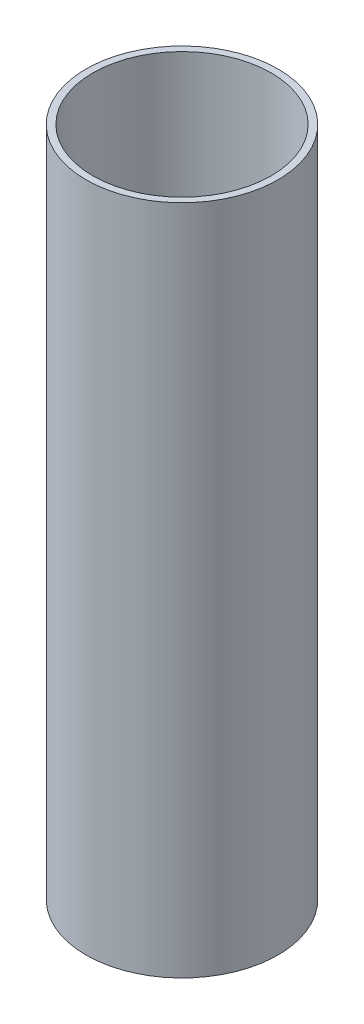
ISO-10303-21;
HEADER;
FILE_DESCRIPTION(('STEP AP214'),'2;1');
FILE_NAME('part.step','',(''),(''),'','','');
FILE_SCHEMA(('AUTOMOTIVE_DESIGN { 1 0 10303 214 1 1 1 1 }'));
ENDSEC;
DATA;
#1=APPLICATION_CONTEXT('core data for automotive mechanical design processes');
#2=APPLICATION_PROTOCOL_DEFINITION('international standard','automotive_design',2000,#1);
#3=PRODUCT_CONTEXT('',#1,'mechanical');
#4=PRODUCT('Part','Part','',(#3));
#5=PRODUCT_RELATED_PRODUCT_CATEGORY('part','',(#4));
#6=PRODUCT_DEFINITION_FORMATION('','',#4);
#7=PRODUCT_DEFINITION_CONTEXT('part definition',#1,'design');
#8=PRODUCT_DEFINITION('design','',#6,#7);
#9=PRODUCT_DEFINITION_SHAPE('','',#8);
#10=(LENGTH_UNIT() NAMED_UNIT(*) SI_UNIT(.MILLI.,.METRE.));
#11=(NAMED_UNIT(*) PLANE_ANGLE_UNIT() SI_UNIT($,.RADIAN.));
#12=(NAMED_UNIT(*) SI_UNIT($,.STERADIAN.) SOLID_ANGLE_UNIT());
#13=UNCERTAINTY_MEASURE_WITH_UNIT(LENGTH_MEASURE(1.E-05),#10,'distance_accuracy_value','');
#14=(GEOMETRIC_REPRESENTATION_CONTEXT(3) GLOBAL_UNCERTAINTY_ASSIGNED_CONTEXT((#13)) GLOBAL_UNIT_ASSIGNED_CONTEXT((#10,
#11,#12)) REPRESENTATION_CONTEXT('',''));
#15=CARTESIAN_POINT('',(0.,0.,0.));
#16=DIRECTION('',(0.,0.,1.));
#17=DIRECTION('',(1.,0.,0.));
#18=AXIS2_PLACEMENT_3D('',#15,#16,#17);
#19=CARTESIAN_POINT('',(0.,-13.97,0.));
#20=DIRECTION('',(0.,-1.,0.));
#21=DIRECTION('',(0.,0.,-1.));
#22=AXIS2_PLACEMENT_3D('',#19,#20,#21);
#23=CYLINDRICAL_SURFACE('',#22,23.622);
#24=CARTESIAN_POINT('',(0.,0.,0.));
#25=DIRECTION('',(0.,-1.,0.));
#26=DIRECTION('',(0.,0.,-1.));
#27=AXIS2_PLACEMENT_3D('',#24,#25,#26);
#28=CIRCLE('',#27,23.622);
#29=CARTESIAN_POINT('',(0.,0.,-23.622));
#30=VERTEX_POINT('',#29);
#31=EDGE_CURVE('E54',#30,#30,#28,.T.);
#32=ORIENTED_EDGE('',*,*,#31,.T.);
#33=EDGE_LOOP('',(#32));
#34=FACE_BOUND('',#33,.T.);
#35=CARTESIAN_POINT('',(0.,177.8,0.));
#36=DIRECTION('',(0.,-1.,0.));
#37=DIRECTION('',(0.,0.,-1.));
#38=AXIS2_PLACEMENT_3D('',#35,#36,#37);
#39=CIRCLE('',#38,23.622);
#40=CARTESIAN_POINT('',(0.,177.8,-23.622));
#41=VERTEX_POINT('',#40);
#42=EDGE_CURVE('E10',#41,#41,#39,.T.);
#43=ORIENTED_EDGE('',*,*,#42,.F.);
#44=EDGE_LOOP('',(#43));
#45=FACE_BOUND('',#44,.T.);
#46=ADVANCED_FACE('F37',(#34,#45),#23,.F.);
#47=CARTESIAN_POINT('',(23.622,177.8,0.));
#48=DIRECTION('',(0.,1.,0.));
#49=DIRECTION('',(0.,0.,1.));
#50=AXIS2_PLACEMENT_3D('',#47,#48,#49);
#51=PLANE('',#50);
#52=ORIENTED_EDGE('',*,*,#42,.T.);
#53=EDGE_LOOP('',(#52));
#54=FACE_BOUND('',#53,.T.);
#55=CARTESIAN_POINT('',(0.,177.8,0.));
#56=DIRECTION('',(0.,-1.,0.));
#57=DIRECTION('',(0.,0.,-1.));
#58=AXIS2_PLACEMENT_3D('',#55,#56,#57);
#59=CIRCLE('',#58,25.4254);
#60=CARTESIAN_POINT('',(0.,177.8,-25.4254));
#61=VERTEX_POINT('',#60);
#62=EDGE_CURVE('E44',#61,#61,#59,.T.);
#63=ORIENTED_EDGE('',*,*,#62,.F.);
#64=EDGE_LOOP('',(#63));
#65=FACE_BOUND('',#64,.T.);
#66=ADVANCED_FACE('F71',(#54,#65),#51,.T.);
#67=CARTESIAN_POINT('',(0.,-13.97,0.));
#68=DIRECTION('',(0.,-1.,0.));
#69=DIRECTION('',(0.,0.,-1.));
#70=AXIS2_PLACEMENT_3D('',#67,#68,#69);
#71=CYLINDRICAL_SURFACE('',#70,25.4254);
#72=ORIENTED_EDGE('',*,*,#62,.T.);
#73=EDGE_LOOP('',(#72));
#74=FACE_BOUND('',#73,.T.);
#75=CARTESIAN_POINT('',(0.,0.,0.));
#76=DIRECTION('',(0.,-1.,0.));
#77=DIRECTION('',(0.,0.,-1.));
#78=AXIS2_PLACEMENT_3D('',#75,#76,#77);
#79=CIRCLE('',#78,25.4254);
#80=CARTESIAN_POINT('',(0.,0.,-25.4254));
#81=VERTEX_POINT('',#80);
#82=EDGE_CURVE('E49',#81,#81,#79,.T.);
#83=ORIENTED_EDGE('',*,*,#82,.F.);
#84=EDGE_LOOP('',(#83));
#85=FACE_BOUND('',#84,.T.);
#86=ADVANCED_FACE('F65',(#74,#85),#71,.T.);
#87=CARTESIAN_POINT('',(23.622,0.,0.));
#88=DIRECTION('',(0.,-1.,0.));
#89=DIRECTION('',(0.,0.,-1.));
#90=AXIS2_PLACEMENT_3D('',#87,#88,#89);
#91=PLANE('',#90);
#92=ORIENTED_EDGE('',*,*,#82,.T.);
#93=EDGE_LOOP('',(#92));
#94=FACE_BOUND('',#93,.T.);
#95=ORIENTED_EDGE('',*,*,#31,.F.);
#96=EDGE_LOOP('',(#95));
#97=FACE_BOUND('',#96,.T.);
#98=ADVANCED_FACE('F63',(#94,#97),#91,.T.);
#99=CLOSED_SHELL('',(#46,#66,#86,#98));
#100=MANIFOLD_SOLID_BREP('B2',#99);
#101=ADVANCED_BREP_SHAPE_REPRESENTATION('',(#18,#100),#14);
#102=SHAPE_DEFINITION_REPRESENTATION(#9,#101);
ENDSEC;
END-ISO-10303-21;
